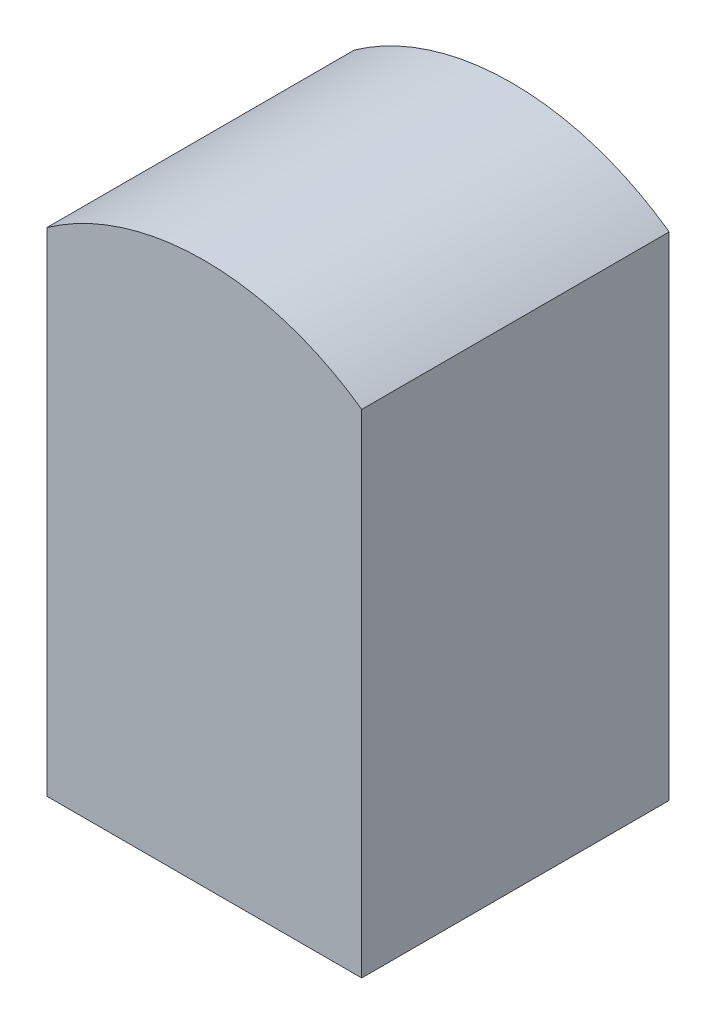
ISO-10303-21;
HEADER;
FILE_DESCRIPTION(('STEP AP214'),'2;1');
FILE_NAME('part.step','',(''),(''),'','','');
FILE_SCHEMA(('AUTOMOTIVE_DESIGN { 1 0 10303 214 1 1 1 1 }'));
ENDSEC;
DATA;
#1=APPLICATION_CONTEXT('core data for automotive mechanical design processes');
#2=APPLICATION_PROTOCOL_DEFINITION('international standard','automotive_design',2000,#1);
#3=PRODUCT_CONTEXT('',#1,'mechanical');
#4=PRODUCT('Part','Part','',(#3));
#5=PRODUCT_RELATED_PRODUCT_CATEGORY('part','',(#4));
#6=PRODUCT_DEFINITION_FORMATION('','',#4);
#7=PRODUCT_DEFINITION_CONTEXT('part definition',#1,'design');
#8=PRODUCT_DEFINITION('design','',#6,#7);
#9=PRODUCT_DEFINITION_SHAPE('','',#8);
#10=(LENGTH_UNIT() NAMED_UNIT(*) SI_UNIT(.MILLI.,.METRE.));
#11=(NAMED_UNIT(*) PLANE_ANGLE_UNIT() SI_UNIT($,.RADIAN.));
#12=(NAMED_UNIT(*) SI_UNIT($,.STERADIAN.) SOLID_ANGLE_UNIT());
#13=UNCERTAINTY_MEASURE_WITH_UNIT(LENGTH_MEASURE(1.E-05),#10,'distance_accuracy_value','');
#14=(GEOMETRIC_REPRESENTATION_CONTEXT(3) GLOBAL_UNCERTAINTY_ASSIGNED_CONTEXT((#13)) GLOBAL_UNIT_ASSIGNED_CONTEXT((#10,
#11,#12)) REPRESENTATION_CONTEXT('',''));
#15=CARTESIAN_POINT('',(0.,0.,0.));
#16=DIRECTION('',(0.,0.,1.));
#17=DIRECTION('',(1.,0.,0.));
#18=AXIS2_PLACEMENT_3D('',#15,#16,#17);
#19=CARTESIAN_POINT('',(42.5,0.,83.));
#20=DIRECTION('',(1.,0.,0.));
#21=DIRECTION('',(0.,1.,0.));
#22=AXIS2_PLACEMENT_3D('',#19,#20,#21);
#23=PLANE('',#22);
#24=DIRECTION('',(0.,-1.,0.));
#25=VECTOR('',#24,1.);
#26=CARTESIAN_POINT('',(42.5,0.,0.));
#27=LINE('',#26,#25);
#28=CARTESIAN_POINT('',(42.5,59.6599740194378,0.));
#29=VERTEX_POINT('',#28);
#30=CARTESIAN_POINT('',(42.5,-73.25,0.));
#31=VERTEX_POINT('',#30);
#32=EDGE_CURVE('E102',#29,#31,#27,.T.);
#33=ORIENTED_EDGE('',*,*,#32,.F.);
#34=DIRECTION('',(0.,0.,-1.));
#35=VECTOR('',#34,1.);
#36=CARTESIAN_POINT('',(42.5,59.6599740194378,83.));
#37=LINE('',#36,#35);
#38=CARTESIAN_POINT('',(42.5,59.6599740194378,83.));
#39=VERTEX_POINT('',#38);
#40=EDGE_CURVE('E11',#39,#29,#37,.T.);
#41=ORIENTED_EDGE('',*,*,#40,.F.);
#42=DIRECTION('',(0.,-1.,0.));
#43=VECTOR('',#42,1.);
#44=CARTESIAN_POINT('',(42.5,0.,83.));
#45=LINE('',#44,#43);
#46=CARTESIAN_POINT('',(42.5,-73.25,83.));
#47=VERTEX_POINT('',#46);
#48=EDGE_CURVE('E90',#39,#47,#45,.T.);
#49=ORIENTED_EDGE('',*,*,#48,.T.);
#50=DIRECTION('',(0.,0.,-1.));
#51=VECTOR('',#50,1.);
#52=CARTESIAN_POINT('',(42.5,-73.25,83.));
#53=LINE('',#52,#51);
#54=EDGE_CURVE('E79',#47,#31,#53,.T.);
#55=ORIENTED_EDGE('',*,*,#54,.T.);
#56=EDGE_LOOP('',(#33,#41,#49,#55));
#57=FACE_BOUND('',#56,.T.);
#58=ADVANCED_FACE('F40',(#57),#23,.T.);
#59=CARTESIAN_POINT('',(0.,0.,83.));
#60=DIRECTION('',(0.,0.,-1.));
#61=DIRECTION('',(-1.,0.,0.));
#62=AXIS2_PLACEMENT_3D('',#59,#60,#61);
#63=CYLINDRICAL_SURFACE('',#62,73.25);
#64=CARTESIAN_POINT('',(0.,0.,0.));
#65=DIRECTION('',(0.,0.,1.));
#66=DIRECTION('',(1.,0.,0.));
#67=AXIS2_PLACEMENT_3D('',#64,#65,#66);
#68=CIRCLE('',#67,73.25);
#69=CARTESIAN_POINT('',(-42.5,59.6599740194378,0.));
#70=VERTEX_POINT('',#69);
#71=EDGE_CURVE('E95',#29,#70,#68,.T.);
#72=ORIENTED_EDGE('',*,*,#71,.T.);
#73=DIRECTION('',(0.,0.,-1.));
#74=VECTOR('',#73,1.);
#75=CARTESIAN_POINT('',(-42.5,59.6599740194378,83.));
#76=LINE('',#75,#74);
#77=CARTESIAN_POINT('',(-42.5,59.6599740194378,83.));
#78=VERTEX_POINT('',#77);
#79=EDGE_CURVE('E48',#78,#70,#76,.T.);
#80=ORIENTED_EDGE('',*,*,#79,.F.);
#81=CARTESIAN_POINT('',(0.,0.,83.));
#82=DIRECTION('',(0.,0.,1.));
#83=DIRECTION('',(1.,0.,0.));
#84=AXIS2_PLACEMENT_3D('',#81,#82,#83);
#85=CIRCLE('',#84,73.25);
#86=EDGE_CURVE('E85',#39,#78,#85,.T.);
#87=ORIENTED_EDGE('',*,*,#86,.F.);
#88=ORIENTED_EDGE('',*,*,#40,.T.);
#89=EDGE_LOOP('',(#72,#80,#87,#88));
#90=FACE_BOUND('',#89,.T.);
#91=ADVANCED_FACE('F93',(#90),#63,.T.);
#92=CARTESIAN_POINT('',(-42.5,0.,83.));
#93=DIRECTION('',(1.,0.,0.));
#94=DIRECTION('',(0.,0.,-1.));
#95=AXIS2_PLACEMENT_3D('',#92,#93,#94);
#96=PLANE('',#95);
#97=DIRECTION('',(0.,-1.,0.));
#98=VECTOR('',#97,1.);
#99=CARTESIAN_POINT('',(-42.5,0.,0.));
#100=LINE('',#99,#98);
#101=CARTESIAN_POINT('',(-42.5,-73.25,0.));
#102=VERTEX_POINT('',#101);
#103=EDGE_CURVE('E72',#70,#102,#100,.T.);
#104=ORIENTED_EDGE('',*,*,#103,.T.);
#105=DIRECTION('',(0.,0.,-1.));
#106=VECTOR('',#105,1.);
#107=CARTESIAN_POINT('',(-42.5,-73.25,83.));
#108=LINE('',#107,#106);
#109=CARTESIAN_POINT('',(-42.5,-73.25,83.));
#110=VERTEX_POINT('',#109);
#111=EDGE_CURVE('E96',#110,#102,#108,.T.);
#112=ORIENTED_EDGE('',*,*,#111,.F.);
#113=DIRECTION('',(0.,-1.,0.));
#114=VECTOR('',#113,1.);
#115=CARTESIAN_POINT('',(-42.5,0.,83.));
#116=LINE('',#115,#114);
#117=EDGE_CURVE('E89',#78,#110,#116,.T.);
#118=ORIENTED_EDGE('',*,*,#117,.F.);
#119=ORIENTED_EDGE('',*,*,#79,.T.);
#120=EDGE_LOOP('',(#104,#112,#118,#119));
#121=FACE_BOUND('',#120,.T.);
#122=ADVANCED_FACE('F97',(#121),#96,.F.);
#123=CARTESIAN_POINT('',(0.,-73.25,83.));
#124=DIRECTION('',(0.,1.,0.));
#125=DIRECTION('',(0.,0.,1.));
#126=AXIS2_PLACEMENT_3D('',#123,#124,#125);
#127=PLANE('',#126);
#128=DIRECTION('',(1.,0.,0.));
#129=VECTOR('',#128,1.);
#130=CARTESIAN_POINT('',(0.,-73.25,0.));
#131=LINE('',#130,#129);
#132=EDGE_CURVE('E107',#102,#31,#131,.T.);
#133=ORIENTED_EDGE('',*,*,#132,.T.);
#134=ORIENTED_EDGE('',*,*,#54,.F.);
#135=DIRECTION('',(1.,0.,0.));
#136=VECTOR('',#135,1.);
#137=CARTESIAN_POINT('',(0.,-73.25,83.));
#138=LINE('',#137,#136);
#139=EDGE_CURVE('E56',#110,#47,#138,.T.);
#140=ORIENTED_EDGE('',*,*,#139,.F.);
#141=ORIENTED_EDGE('',*,*,#111,.T.);
#142=EDGE_LOOP('',(#133,#134,#140,#141));
#143=FACE_BOUND('',#142,.T.);
#144=ADVANCED_FACE('F112',(#143),#127,.F.);
#145=CARTESIAN_POINT('',(0.,0.,83.));
#146=DIRECTION('',(0.,0.,1.));
#147=DIRECTION('',(1.,0.,0.));
#148=AXIS2_PLACEMENT_3D('',#145,#146,#147);
#149=PLANE('',#148);
#150=ORIENTED_EDGE('',*,*,#48,.F.);
#151=ORIENTED_EDGE('',*,*,#86,.T.);
#152=ORIENTED_EDGE('',*,*,#117,.T.);
#153=ORIENTED_EDGE('',*,*,#139,.T.);
#154=EDGE_LOOP('',(#150,#151,#152,#153));
#155=FACE_BOUND('',#154,.T.);
#156=ADVANCED_FACE('F87',(#155),#149,.T.);
#157=CARTESIAN_POINT('',(0.,0.,0.));
#158=DIRECTION('',(0.,0.,1.));
#159=DIRECTION('',(1.,0.,0.));
#160=AXIS2_PLACEMENT_3D('',#157,#158,#159);
#161=PLANE('',#160);
#162=ORIENTED_EDGE('',*,*,#32,.T.);
#163=ORIENTED_EDGE('',*,*,#132,.F.);
#164=ORIENTED_EDGE('',*,*,#103,.F.);
#165=ORIENTED_EDGE('',*,*,#71,.F.);
#166=EDGE_LOOP('',(#162,#163,#164,#165));
#167=FACE_BOUND('',#166,.T.);
#168=ADVANCED_FACE('F114',(#167),#161,.F.);
#169=CLOSED_SHELL('',(#58,#91,#122,#144,#156,#168));
#170=MANIFOLD_SOLID_BREP('B2',#169);
#171=ADVANCED_BREP_SHAPE_REPRESENTATION('',(#18,#170),#14);
#172=SHAPE_DEFINITION_REPRESENTATION(#9,#171);
ENDSEC;
END-ISO-10303-21;
